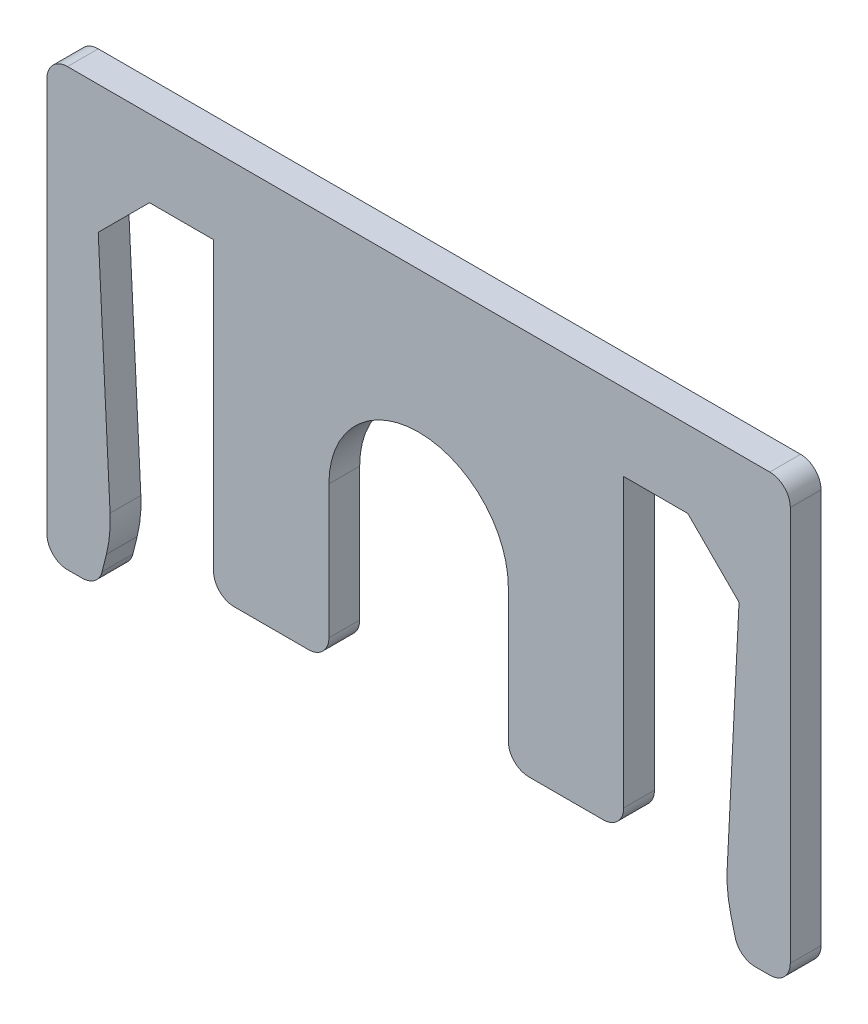
ISO-10303-21;
HEADER;
FILE_DESCRIPTION(('STEP AP214'),'2;1');
FILE_NAME('part.step','',(''),(''),'','','');
FILE_SCHEMA(('AUTOMOTIVE_DESIGN { 1 0 10303 214 1 1 1 1 }'));
ENDSEC;
DATA;
#1=APPLICATION_CONTEXT('core data for automotive mechanical design processes');
#2=APPLICATION_PROTOCOL_DEFINITION('international standard','automotive_design',2000,#1);
#3=PRODUCT_CONTEXT('',#1,'mechanical');
#4=PRODUCT('Part','Part','',(#3));
#5=PRODUCT_RELATED_PRODUCT_CATEGORY('part','',(#4));
#6=PRODUCT_DEFINITION_FORMATION('','',#4);
#7=PRODUCT_DEFINITION_CONTEXT('part definition',#1,'design');
#8=PRODUCT_DEFINITION('design','',#6,#7);
#9=PRODUCT_DEFINITION_SHAPE('','',#8);
#10=(LENGTH_UNIT() NAMED_UNIT(*) SI_UNIT(.MILLI.,.METRE.));
#11=(NAMED_UNIT(*) PLANE_ANGLE_UNIT() SI_UNIT($,.RADIAN.));
#12=(NAMED_UNIT(*) SI_UNIT($,.STERADIAN.) SOLID_ANGLE_UNIT());
#13=UNCERTAINTY_MEASURE_WITH_UNIT(LENGTH_MEASURE(1.E-05),#10,'distance_accuracy_value','');
#14=(GEOMETRIC_REPRESENTATION_CONTEXT(3) GLOBAL_UNCERTAINTY_ASSIGNED_CONTEXT((#13)) GLOBAL_UNIT_ASSIGNED_CONTEXT((#10,
#11,#12)) REPRESENTATION_CONTEXT('',''));
#15=CARTESIAN_POINT('',(0.,0.,0.));
#16=DIRECTION('',(0.,0.,1.));
#17=DIRECTION('',(1.,0.,0.));
#18=AXIS2_PLACEMENT_3D('',#15,#16,#17);
#19=CARTESIAN_POINT('',(-10.5,0.,1.2));
#20=DIRECTION('',(0.,1.,0.));
#21=DIRECTION('',(-1.,0.,0.));
#22=AXIS2_PLACEMENT_3D('',#19,#20,#21);
#23=PLANE('',#22);
#24=DIRECTION('',(1.,0.,0.));
#25=VECTOR('',#24,1.);
#26=CARTESIAN_POINT('',(-10.5,0.,0.));
#27=LINE('',#26,#25);
#28=CARTESIAN_POINT('',(-10.5,0.,0.));
#29=VERTEX_POINT('',#28);
#30=CARTESIAN_POINT('',(-8.,0.,0.));
#31=VERTEX_POINT('',#30);
#32=EDGE_CURVE('E277',#29,#31,#27,.T.);
#33=ORIENTED_EDGE('',*,*,#32,.T.);
#34=DIRECTION('',(0.,0.,-1.));
#35=VECTOR('',#34,1.);
#36=CARTESIAN_POINT('',(-8.,0.,1.2));
#37=LINE('',#36,#35);
#38=CARTESIAN_POINT('',(-8.,0.,1.2));
#39=VERTEX_POINT('',#38);
#40=EDGE_CURVE('E256',#39,#31,#37,.T.);
#41=ORIENTED_EDGE('',*,*,#40,.F.);
#42=DIRECTION('',(1.,0.,0.));
#43=VECTOR('',#42,1.);
#44=CARTESIAN_POINT('',(-10.5,0.,1.2));
#45=LINE('',#44,#43);
#46=CARTESIAN_POINT('',(-10.5,0.,1.2));
#47=VERTEX_POINT('',#46);
#48=EDGE_CURVE('E263',#47,#39,#45,.T.);
#49=ORIENTED_EDGE('',*,*,#48,.F.);
#50=DIRECTION('',(0.,0.,-1.));
#51=VECTOR('',#50,1.);
#52=CARTESIAN_POINT('',(-10.5,0.,1.2));
#53=LINE('',#52,#51);
#54=EDGE_CURVE('E518',#47,#29,#53,.T.);
#55=ORIENTED_EDGE('',*,*,#54,.T.);
#56=EDGE_LOOP('',(#33,#41,#49,#55));
#57=FACE_BOUND('',#56,.T.);
#58=ADVANCED_FACE('F39',(#57),#23,.F.);
#59=CARTESIAN_POINT('',(-8.,-12.,1.2));
#60=DIRECTION('',(1.,0.,0.));
#61=DIRECTION('',(0.,0.,-1.));
#62=AXIS2_PLACEMENT_3D('',#59,#60,#61);
#63=PLANE('',#62);
#64=DIRECTION('',(0.,-1.,0.));
#65=VECTOR('',#64,1.);
#66=CARTESIAN_POINT('',(-8.,-12.,0.));
#67=LINE('',#66,#65);
#68=CARTESIAN_POINT('',(-8.,-11.2,0.));
#69=VERTEX_POINT('',#68);
#70=EDGE_CURVE('E549',#31,#69,#67,.T.);
#71=ORIENTED_EDGE('',*,*,#70,.T.);
#72=DIRECTION('',(0.,0.,-1.));
#73=VECTOR('',#72,1.);
#74=CARTESIAN_POINT('',(-8.,-11.2,1.2));
#75=LINE('',#74,#73);
#76=CARTESIAN_POINT('',(-8.,-11.2,1.2));
#77=VERTEX_POINT('',#76);
#78=EDGE_CURVE('E259',#69,#77,#75,.F.);
#79=ORIENTED_EDGE('',*,*,#78,.T.);
#80=DIRECTION('',(0.,-1.,0.));
#81=VECTOR('',#80,1.);
#82=CARTESIAN_POINT('',(-8.,-12.,1.2));
#83=LINE('',#82,#81);
#84=EDGE_CURVE('E251',#39,#77,#83,.T.);
#85=ORIENTED_EDGE('',*,*,#84,.F.);
#86=ORIENTED_EDGE('',*,*,#40,.T.);
#87=EDGE_LOOP('',(#71,#79,#85,#86));
#88=FACE_BOUND('',#87,.T.);
#89=ADVANCED_FACE('F254',(#88),#63,.F.);
#90=CARTESIAN_POINT('',(-8.,-12.,1.2));
#91=DIRECTION('',(0.,1.,0.));
#92=DIRECTION('',(-1.,0.,0.));
#93=AXIS2_PLACEMENT_3D('',#90,#91,#92);
#94=PLANE('',#93);
#95=DIRECTION('',(1.,0.,0.));
#96=VECTOR('',#95,1.);
#97=CARTESIAN_POINT('',(-8.,-12.,1.2));
#98=LINE('',#97,#96);
#99=CARTESIAN_POINT('',(-7.2,-12.,1.2));
#100=VERTEX_POINT('',#99);
#101=CARTESIAN_POINT('',(-4.3,-12.,1.2));
#102=VERTEX_POINT('',#101);
#103=EDGE_CURVE('E262',#100,#102,#98,.T.);
#104=ORIENTED_EDGE('',*,*,#103,.F.);
#105=DIRECTION('',(0.,0.,-1.));
#106=VECTOR('',#105,1.);
#107=CARTESIAN_POINT('',(-7.2,-12.,1.2));
#108=LINE('',#107,#106);
#109=CARTESIAN_POINT('',(-7.2,-12.,0.));
#110=VERTEX_POINT('',#109);
#111=EDGE_CURVE('E418',#100,#110,#108,.T.);
#112=ORIENTED_EDGE('',*,*,#111,.T.);
#113=DIRECTION('',(1.,0.,0.));
#114=VECTOR('',#113,1.);
#115=CARTESIAN_POINT('',(-8.,-12.,0.));
#116=LINE('',#115,#114);
#117=CARTESIAN_POINT('',(-4.3,-12.,0.));
#118=VERTEX_POINT('',#117);
#119=EDGE_CURVE('E543',#110,#118,#116,.T.);
#120=ORIENTED_EDGE('',*,*,#119,.T.);
#121=DIRECTION('',(0.,0.,-1.));
#122=VECTOR('',#121,1.);
#123=CARTESIAN_POINT('',(-4.3,-12.,1.2));
#124=LINE('',#123,#122);
#125=EDGE_CURVE('E415',#118,#102,#124,.F.);
#126=ORIENTED_EDGE('',*,*,#125,.T.);
#127=EDGE_LOOP('',(#104,#112,#120,#126));
#128=FACE_BOUND('',#127,.T.);
#129=ADVANCED_FACE('F624',(#128),#94,.F.);
#130=CARTESIAN_POINT('',(-3.5,-6.,1.2));
#131=DIRECTION('',(-1.,0.,0.));
#132=DIRECTION('',(0.,-1.,0.));
#133=AXIS2_PLACEMENT_3D('',#130,#131,#132);
#134=PLANE('',#133);
#135=DIRECTION('',(0.,1.,0.));
#136=VECTOR('',#135,1.);
#137=CARTESIAN_POINT('',(-3.5,-6.,1.2));
#138=LINE('',#137,#136);
#139=CARTESIAN_POINT('',(-3.5,-11.2,1.2));
#140=VERTEX_POINT('',#139);
#141=CARTESIAN_POINT('',(-3.5,-6.,1.2));
#142=VERTEX_POINT('',#141);
#143=EDGE_CURVE('E600',#140,#142,#138,.T.);
#144=ORIENTED_EDGE('',*,*,#143,.F.);
#145=DIRECTION('',(0.,0.,-1.));
#146=VECTOR('',#145,1.);
#147=CARTESIAN_POINT('',(-3.5,-11.2,1.2));
#148=LINE('',#147,#146);
#149=CARTESIAN_POINT('',(-3.5,-11.2,0.));
#150=VERTEX_POINT('',#149);
#151=EDGE_CURVE('E11',#140,#150,#148,.T.);
#152=ORIENTED_EDGE('',*,*,#151,.T.);
#153=DIRECTION('',(0.,1.,0.));
#154=VECTOR('',#153,1.);
#155=CARTESIAN_POINT('',(-3.5,-6.,0.));
#156=LINE('',#155,#154);
#157=CARTESIAN_POINT('',(-3.5,-6.,0.));
#158=VERTEX_POINT('',#157);
#159=EDGE_CURVE('E540',#150,#158,#156,.T.);
#160=ORIENTED_EDGE('',*,*,#159,.T.);
#161=DIRECTION('',(0.,0.,-1.));
#162=VECTOR('',#161,1.);
#163=CARTESIAN_POINT('',(-3.5,-6.,1.2));
#164=LINE('',#163,#162);
#165=EDGE_CURVE('E280',#142,#158,#164,.T.);
#166=ORIENTED_EDGE('',*,*,#165,.F.);
#167=EDGE_LOOP('',(#144,#152,#160,#166));
#168=FACE_BOUND('',#167,.T.);
#169=ADVANCED_FACE('F614',(#168),#134,.F.);
#170=CARTESIAN_POINT('',(0.,-6.,1.2));
#171=DIRECTION('',(0.,0.,-1.));
#172=DIRECTION('',(-1.,0.,0.));
#173=AXIS2_PLACEMENT_3D('',#170,#171,#172);
#174=CYLINDRICAL_SURFACE('',#173,3.5);
#175=CARTESIAN_POINT('',(0.,-6.,0.));
#176=DIRECTION('',(0.,0.,-1.));
#177=DIRECTION('',(1.,0.,0.));
#178=AXIS2_PLACEMENT_3D('',#175,#176,#177);
#179=CIRCLE('',#178,3.5);
#180=CARTESIAN_POINT('',(3.5,-6.,0.));
#181=VERTEX_POINT('',#180);
#182=EDGE_CURVE('E474',#158,#181,#179,.T.);
#183=ORIENTED_EDGE('',*,*,#182,.T.);
#184=DIRECTION('',(0.,0.,-1.));
#185=VECTOR('',#184,1.);
#186=CARTESIAN_POINT('',(3.5,-6.,1.2));
#187=LINE('',#186,#185);
#188=CARTESIAN_POINT('',(3.5,-6.,1.2));
#189=VERTEX_POINT('',#188);
#190=EDGE_CURVE('E288',#189,#181,#187,.T.);
#191=ORIENTED_EDGE('',*,*,#190,.F.);
#192=CARTESIAN_POINT('',(0.,-6.,1.2));
#193=DIRECTION('',(0.,0.,-1.));
#194=DIRECTION('',(1.,0.,0.));
#195=AXIS2_PLACEMENT_3D('',#192,#193,#194);
#196=CIRCLE('',#195,3.5);
#197=EDGE_CURVE('E450',#142,#189,#196,.T.);
#198=ORIENTED_EDGE('',*,*,#197,.F.);
#199=ORIENTED_EDGE('',*,*,#165,.T.);
#200=EDGE_LOOP('',(#183,#191,#198,#199));
#201=FACE_BOUND('',#200,.T.);
#202=ADVANCED_FACE('F616',(#201),#174,.F.);
#203=CARTESIAN_POINT('',(3.5,-6.,1.2));
#204=DIRECTION('',(1.,0.,0.));
#205=DIRECTION('',(0.,1.,0.));
#206=AXIS2_PLACEMENT_3D('',#203,#204,#205);
#207=PLANE('',#206);
#208=DIRECTION('',(0.,-1.,0.));
#209=VECTOR('',#208,1.);
#210=CARTESIAN_POINT('',(3.5,-6.,0.));
#211=LINE('',#210,#209);
#212=CARTESIAN_POINT('',(3.5,-11.2,0.));
#213=VERTEX_POINT('',#212);
#214=EDGE_CURVE('E444',#181,#213,#211,.T.);
#215=ORIENTED_EDGE('',*,*,#214,.T.);
#216=DIRECTION('',(0.,0.,-1.));
#217=VECTOR('',#216,1.);
#218=CARTESIAN_POINT('',(3.5,-11.2,1.2));
#219=LINE('',#218,#217);
#220=CARTESIAN_POINT('',(3.5,-11.2,1.2));
#221=VERTEX_POINT('',#220);
#222=EDGE_CURVE('E48',#213,#221,#219,.F.);
#223=ORIENTED_EDGE('',*,*,#222,.T.);
#224=DIRECTION('',(0.,-1.,0.));
#225=VECTOR('',#224,1.);
#226=CARTESIAN_POINT('',(3.5,-6.,1.2));
#227=LINE('',#226,#225);
#228=EDGE_CURVE('E442',#189,#221,#227,.T.);
#229=ORIENTED_EDGE('',*,*,#228,.F.);
#230=ORIENTED_EDGE('',*,*,#190,.T.);
#231=EDGE_LOOP('',(#215,#223,#229,#230));
#232=FACE_BOUND('',#231,.T.);
#233=ADVANCED_FACE('F440',(#232),#207,.F.);
#234=CARTESIAN_POINT('',(3.5,-12.,1.2));
#235=DIRECTION('',(0.,1.,0.));
#236=DIRECTION('',(-1.,0.,0.));
#237=AXIS2_PLACEMENT_3D('',#234,#235,#236);
#238=PLANE('',#237);
#239=DIRECTION('',(1.,0.,0.));
#240=VECTOR('',#239,1.);
#241=CARTESIAN_POINT('',(3.5,-12.,0.));
#242=LINE('',#241,#240);
#243=CARTESIAN_POINT('',(4.3,-12.,0.));
#244=VERTEX_POINT('',#243);
#245=CARTESIAN_POINT('',(7.2,-12.,0.));
#246=VERTEX_POINT('',#245);
#247=EDGE_CURVE('E461',#244,#246,#242,.T.);
#248=ORIENTED_EDGE('',*,*,#247,.T.);
#249=DIRECTION('',(0.,0.,-1.));
#250=VECTOR('',#249,1.);
#251=CARTESIAN_POINT('',(7.2,-12.,1.2));
#252=LINE('',#251,#250);
#253=CARTESIAN_POINT('',(7.2,-12.,1.2));
#254=VERTEX_POINT('',#253);
#255=EDGE_CURVE('E432',#246,#254,#252,.F.);
#256=ORIENTED_EDGE('',*,*,#255,.T.);
#257=DIRECTION('',(1.,0.,0.));
#258=VECTOR('',#257,1.);
#259=CARTESIAN_POINT('',(3.5,-12.,1.2));
#260=LINE('',#259,#258);
#261=CARTESIAN_POINT('',(4.3,-12.,1.2));
#262=VERTEX_POINT('',#261);
#263=EDGE_CURVE('E453',#262,#254,#260,.T.);
#264=ORIENTED_EDGE('',*,*,#263,.F.);
#265=DIRECTION('',(0.,0.,-1.));
#266=VECTOR('',#265,1.);
#267=CARTESIAN_POINT('',(4.3,-12.,1.2));
#268=LINE('',#267,#266);
#269=EDGE_CURVE('E428',#262,#244,#268,.T.);
#270=ORIENTED_EDGE('',*,*,#269,.T.);
#271=EDGE_LOOP('',(#248,#256,#264,#270));
#272=FACE_BOUND('',#271,.T.);
#273=ADVANCED_FACE('F460',(#272),#238,.F.);
#274=CARTESIAN_POINT('',(8.,-12.,1.2));
#275=DIRECTION('',(-1.,0.,0.));
#276=DIRECTION('',(0.,0.,1.));
#277=AXIS2_PLACEMENT_3D('',#274,#275,#276);
#278=PLANE('',#277);
#279=DIRECTION('',(0.,1.,0.));
#280=VECTOR('',#279,1.);
#281=CARTESIAN_POINT('',(8.,-12.,1.2));
#282=LINE('',#281,#280);
#283=CARTESIAN_POINT('',(8.,-11.2,1.2));
#284=VERTEX_POINT('',#283);
#285=CARTESIAN_POINT('',(8.,0.,1.2));
#286=VERTEX_POINT('',#285);
#287=EDGE_CURVE('E593',#284,#286,#282,.T.);
#288=ORIENTED_EDGE('',*,*,#287,.F.);
#289=DIRECTION('',(0.,0.,-1.));
#290=VECTOR('',#289,1.);
#291=CARTESIAN_POINT('',(8.,-11.2,1.2));
#292=LINE('',#291,#290);
#293=CARTESIAN_POINT('',(8.,-11.2,0.));
#294=VERTEX_POINT('',#293);
#295=EDGE_CURVE('E424',#284,#294,#292,.T.);
#296=ORIENTED_EDGE('',*,*,#295,.T.);
#297=DIRECTION('',(0.,1.,0.));
#298=VECTOR('',#297,1.);
#299=CARTESIAN_POINT('',(8.,-12.,0.));
#300=LINE('',#299,#298);
#301=CARTESIAN_POINT('',(8.,0.,0.));
#302=VERTEX_POINT('',#301);
#303=EDGE_CURVE('E468',#294,#302,#300,.T.);
#304=ORIENTED_EDGE('',*,*,#303,.T.);
#305=DIRECTION('',(0.,0.,-1.));
#306=VECTOR('',#305,1.);
#307=CARTESIAN_POINT('',(8.,0.,1.2));
#308=LINE('',#307,#306);
#309=EDGE_CURVE('E533',#286,#302,#308,.T.);
#310=ORIENTED_EDGE('',*,*,#309,.F.);
#311=EDGE_LOOP('',(#288,#296,#304,#310));
#312=FACE_BOUND('',#311,.T.);
#313=ADVANCED_FACE('F834',(#312),#278,.F.);
#314=CARTESIAN_POINT('',(8.,0.,1.2));
#315=DIRECTION('',(0.,1.,0.));
#316=DIRECTION('',(-1.,0.,0.));
#317=AXIS2_PLACEMENT_3D('',#314,#315,#316);
#318=PLANE('',#317);
#319=DIRECTION('',(1.,0.,0.));
#320=VECTOR('',#319,1.);
#321=CARTESIAN_POINT('',(8.,0.,0.));
#322=LINE('',#321,#320);
#323=CARTESIAN_POINT('',(10.5,0.,0.));
#324=VERTEX_POINT('',#323);
#325=EDGE_CURVE('E472',#302,#324,#322,.T.);
#326=ORIENTED_EDGE('',*,*,#325,.T.);
#327=DIRECTION('',(0.,0.,-1.));
#328=VECTOR('',#327,1.);
#329=CARTESIAN_POINT('',(10.5,0.,1.2));
#330=LINE('',#329,#328);
#331=CARTESIAN_POINT('',(10.5,0.,1.2));
#332=VERTEX_POINT('',#331);
#333=EDGE_CURVE('E529',#332,#324,#330,.T.);
#334=ORIENTED_EDGE('',*,*,#333,.F.);
#335=DIRECTION('',(1.,0.,0.));
#336=VECTOR('',#335,1.);
#337=CARTESIAN_POINT('',(8.,0.,1.2));
#338=LINE('',#337,#336);
#339=EDGE_CURVE('E590',#286,#332,#338,.T.);
#340=ORIENTED_EDGE('',*,*,#339,.F.);
#341=ORIENTED_EDGE('',*,*,#309,.T.);
#342=EDGE_LOOP('',(#326,#334,#340,#341));
#343=FACE_BOUND('',#342,.T.);
#344=ADVANCED_FACE('F839',(#343),#318,.F.);
#345=CARTESIAN_POINT('',(12.5,-2.,1.2));
#346=DIRECTION('',(0.707106781186547,0.707106781186548,0.));
#347=DIRECTION('',(-0.707106781186548,0.707106781186547,0.));
#348=AXIS2_PLACEMENT_3D('',#345,#346,#347);
#349=PLANE('',#348);
#350=DIRECTION('',(0.707106781186548,-0.707106781186547,0.));
#351=VECTOR('',#350,1.);
#352=CARTESIAN_POINT('',(12.5,-2.,0.));
#353=LINE('',#352,#351);
#354=CARTESIAN_POINT('',(12.5,-2.,0.));
#355=VERTEX_POINT('',#354);
#356=EDGE_CURVE('E480',#324,#355,#353,.T.);
#357=ORIENTED_EDGE('',*,*,#356,.T.);
#358=DIRECTION('',(0.,0.,-1.));
#359=VECTOR('',#358,1.);
#360=CARTESIAN_POINT('',(12.5,-2.,1.2));
#361=LINE('',#360,#359);
#362=CARTESIAN_POINT('',(12.5,-2.,1.2));
#363=VERTEX_POINT('',#362);
#364=EDGE_CURVE('E525',#363,#355,#361,.T.);
#365=ORIENTED_EDGE('',*,*,#364,.F.);
#366=DIRECTION('',(0.707106781186548,-0.707106781186547,0.));
#367=VECTOR('',#366,1.);
#368=CARTESIAN_POINT('',(12.5,-2.,1.2));
#369=LINE('',#368,#367);
#370=EDGE_CURVE('E587',#332,#363,#369,.T.);
#371=ORIENTED_EDGE('',*,*,#370,.F.);
#372=ORIENTED_EDGE('',*,*,#333,.T.);
#373=EDGE_LOOP('',(#357,#365,#371,#372));
#374=FACE_BOUND('',#373,.T.);
#375=ADVANCED_FACE('F901',(#374),#349,.F.);
#376=CARTESIAN_POINT('',(12.,-12.,1.2));
#377=DIRECTION('',(0.998752338877844,-0.0499376169438947,0.));
#378=DIRECTION('',(0.0499376169438947,0.998752338877845,0.));
#379=AXIS2_PLACEMENT_3D('',#376,#377,#378);
#380=PLANE('',#379);
#381=DIRECTION('',(-0.0499376169438947,-0.998752338877845,0.));
#382=VECTOR('',#381,1.);
#383=CARTESIAN_POINT('',(12.,-12.,0.));
#384=LINE('',#383,#382);
#385=CARTESIAN_POINT('',(12.0370903931354,-11.2581921372909,0.));
#386=VERTEX_POINT('',#385);
#387=EDGE_CURVE('E483',#355,#386,#384,.T.);
#388=ORIENTED_EDGE('',*,*,#387,.T.);
#389=DIRECTION('',(0.,0.,-1.));
#390=VECTOR('',#389,1.);
#391=CARTESIAN_POINT('',(12.0370903931354,-11.2581921372909,1.2));
#392=LINE('',#391,#390);
#393=CARTESIAN_POINT('',(12.0370903931354,-11.2581921372909,1.2));
#394=VERTEX_POINT('',#393);
#395=EDGE_CURVE('E312',#386,#394,#392,.F.);
#396=ORIENTED_EDGE('',*,*,#395,.T.);
#397=DIRECTION('',(-0.0499376169438947,-0.998752338877845,0.));
#398=VECTOR('',#397,1.);
#399=CARTESIAN_POINT('',(12.,-12.,1.2));
#400=LINE('',#399,#398);
#401=EDGE_CURVE('E583',#363,#394,#400,.T.);
#402=ORIENTED_EDGE('',*,*,#401,.F.);
#403=ORIENTED_EDGE('',*,*,#364,.T.);
#404=EDGE_LOOP('',(#388,#396,#402,#403));
#405=FACE_BOUND('',#404,.T.);
#406=ADVANCED_FACE('F826',(#405),#380,.F.);
#407=CARTESIAN_POINT('',(12.5,-14.,1.2));
#408=DIRECTION('',(0.970142500145332,0.242535625036332,0.));
#409=DIRECTION('',(-0.242535625036332,0.970142500145332,0.));
#410=AXIS2_PLACEMENT_3D('',#407,#408,#409);
#411=PLANE('',#410);
#412=DIRECTION('',(0.242535625036332,-0.970142500145332,0.));
#413=VECTOR('',#412,1.);
#414=CARTESIAN_POINT('',(12.5,-14.,0.));
#415=LINE('',#414,#413);
#416=CARTESIAN_POINT('',(12.180139586798,-12.7205583471921,0.));
#417=VERTEX_POINT('',#416);
#418=CARTESIAN_POINT('',(12.3485071250072,-13.3940285000291,0.));
#419=VERTEX_POINT('',#418);
#420=EDGE_CURVE('E487',#417,#419,#415,.T.);
#421=ORIENTED_EDGE('',*,*,#420,.T.);
#422=DIRECTION('',(0.,0.,-1.));
#423=VECTOR('',#422,1.);
#424=CARTESIAN_POINT('',(12.3485071250072,-13.3940285000291,1.2));
#425=LINE('',#424,#423);
#426=CARTESIAN_POINT('',(12.3485071250072,-13.3940285000291,1.2));
#427=VERTEX_POINT('',#426);
#428=EDGE_CURVE('E408',#419,#427,#425,.F.);
#429=ORIENTED_EDGE('',*,*,#428,.T.);
#430=DIRECTION('',(0.242535625036332,-0.970142500145332,0.));
#431=VECTOR('',#430,1.);
#432=CARTESIAN_POINT('',(12.5,-14.,1.2));
#433=LINE('',#432,#431);
#434=CARTESIAN_POINT('',(12.180139586798,-12.7205583471921,1.2));
#435=VERTEX_POINT('',#434);
#436=EDGE_CURVE('E579',#435,#427,#433,.T.);
#437=ORIENTED_EDGE('',*,*,#436,.F.);
#438=DIRECTION('',(0.,0.,-1.));
#439=VECTOR('',#438,1.);
#440=CARTESIAN_POINT('',(12.180139586798,-12.7205583471921,1.2));
#441=LINE('',#440,#439);
#442=EDGE_CURVE('E308',#435,#417,#441,.T.);
#443=ORIENTED_EDGE('',*,*,#442,.T.);
#444=EDGE_LOOP('',(#421,#429,#437,#443));
#445=FACE_BOUND('',#444,.T.);
#446=ADVANCED_FACE('F816',(#445),#411,.F.);
#447=CARTESIAN_POINT('',(12.5,-14.,1.2));
#448=DIRECTION('',(0.,1.,0.));
#449=DIRECTION('',(0.,0.,1.));
#450=AXIS2_PLACEMENT_3D('',#447,#448,#449);
#451=PLANE('',#450);
#452=DIRECTION('',(1.,0.,0.));
#453=VECTOR('',#452,1.);
#454=CARTESIAN_POINT('',(12.5,-14.,0.));
#455=LINE('',#454,#453);
#456=CARTESIAN_POINT('',(13.1246211251235,-14.,0.));
#457=VERTEX_POINT('',#456);
#458=CARTESIAN_POINT('',(13.7,-14.,0.));
#459=VERTEX_POINT('',#458);
#460=EDGE_CURVE('E491',#457,#459,#455,.T.);
#461=ORIENTED_EDGE('',*,*,#460,.T.);
#462=DIRECTION('',(0.,0.,-1.));
#463=VECTOR('',#462,1.);
#464=CARTESIAN_POINT('',(13.7,-14.,1.2));
#465=LINE('',#464,#463);
#466=CARTESIAN_POINT('',(13.7,-14.,1.2));
#467=VERTEX_POINT('',#466);
#468=EDGE_CURVE('E399',#459,#467,#465,.F.);
#469=ORIENTED_EDGE('',*,*,#468,.T.);
#470=DIRECTION('',(1.,0.,0.));
#471=VECTOR('',#470,1.);
#472=CARTESIAN_POINT('',(12.5,-14.,1.2));
#473=LINE('',#472,#471);
#474=CARTESIAN_POINT('',(13.1246211251235,-14.,1.2));
#475=VERTEX_POINT('',#474);
#476=EDGE_CURVE('E575',#475,#467,#473,.T.);
#477=ORIENTED_EDGE('',*,*,#476,.F.);
#478=DIRECTION('',(0.,0.,-1.));
#479=VECTOR('',#478,1.);
#480=CARTESIAN_POINT('',(13.1246211251235,-14.,1.2));
#481=LINE('',#480,#479);
#482=EDGE_CURVE('E395',#475,#457,#481,.T.);
#483=ORIENTED_EDGE('',*,*,#482,.T.);
#484=EDGE_LOOP('',(#461,#469,#477,#483));
#485=FACE_BOUND('',#484,.T.);
#486=ADVANCED_FACE('F805',(#485),#451,.F.);
#487=CARTESIAN_POINT('',(14.5,-14.,1.2));
#488=DIRECTION('',(-1.,0.,0.));
#489=DIRECTION('',(0.,0.,1.));
#490=AXIS2_PLACEMENT_3D('',#487,#488,#489);
#491=PLANE('',#490);
#492=DIRECTION('',(0.,1.,0.));
#493=VECTOR('',#492,1.);
#494=CARTESIAN_POINT('',(14.5,-14.,0.));
#495=LINE('',#494,#493);
#496=CARTESIAN_POINT('',(14.5,-13.2,0.));
#497=VERTEX_POINT('',#496);
#498=CARTESIAN_POINT('',(14.5,2.2,0.));
#499=VERTEX_POINT('',#498);
#500=EDGE_CURVE('E495',#497,#499,#495,.T.);
#501=ORIENTED_EDGE('',*,*,#500,.T.);
#502=DIRECTION('',(0.,0.,-1.));
#503=VECTOR('',#502,1.);
#504=CARTESIAN_POINT('',(14.5,2.2,1.2));
#505=LINE('',#504,#503);
#506=CARTESIAN_POINT('',(14.5,2.2,1.2));
#507=VERTEX_POINT('',#506);
#508=EDGE_CURVE('E356',#499,#507,#505,.F.);
#509=ORIENTED_EDGE('',*,*,#508,.T.);
#510=DIRECTION('',(0.,1.,0.));
#511=VECTOR('',#510,1.);
#512=CARTESIAN_POINT('',(14.5,-14.,1.2));
#513=LINE('',#512,#511);
#514=CARTESIAN_POINT('',(14.5,-13.2,1.2));
#515=VERTEX_POINT('',#514);
#516=EDGE_CURVE('E572',#515,#507,#513,.T.);
#517=ORIENTED_EDGE('',*,*,#516,.F.);
#518=DIRECTION('',(0.,0.,-1.));
#519=VECTOR('',#518,1.);
#520=CARTESIAN_POINT('',(14.5,-13.2,1.2));
#521=LINE('',#520,#519);
#522=EDGE_CURVE('E352',#515,#497,#521,.T.);
#523=ORIENTED_EDGE('',*,*,#522,.T.);
#524=EDGE_LOOP('',(#501,#509,#517,#523));
#525=FACE_BOUND('',#524,.T.);
#526=ADVANCED_FACE('F794',(#525),#491,.F.);
#527=CARTESIAN_POINT('',(-12.5,3.,1.2));
#528=DIRECTION('',(0.,-1.,0.));
#529=DIRECTION('',(1.,0.,0.));
#530=AXIS2_PLACEMENT_3D('',#527,#528,#529);
#531=PLANE('',#530);
#532=DIRECTION('',(-1.,0.,0.));
#533=VECTOR('',#532,1.);
#534=CARTESIAN_POINT('',(12.5,3.,1.2));
#535=LINE('',#534,#533);
#536=CARTESIAN_POINT('',(13.7,3.,1.2));
#537=VERTEX_POINT('',#536);
#538=CARTESIAN_POINT('',(-13.7,3.,1.2));
#539=VERTEX_POINT('',#538);
#540=EDGE_CURVE('E568',#537,#539,#535,.T.);
#541=ORIENTED_EDGE('',*,*,#540,.F.);
#542=DIRECTION('',(0.,0.,-1.));
#543=VECTOR('',#542,1.);
#544=CARTESIAN_POINT('',(13.7,3.,1.2));
#545=LINE('',#544,#543);
#546=CARTESIAN_POINT('',(13.7,3.,0.));
#547=VERTEX_POINT('',#546);
#548=EDGE_CURVE('E318',#537,#547,#545,.T.);
#549=ORIENTED_EDGE('',*,*,#548,.T.);
#550=DIRECTION('',(-1.,0.,0.));
#551=VECTOR('',#550,1.);
#552=CARTESIAN_POINT('',(-12.5,3.,0.));
#553=LINE('',#552,#551);
#554=CARTESIAN_POINT('',(-13.7,3.,0.));
#555=VERTEX_POINT('',#554);
#556=EDGE_CURVE('E499',#547,#555,#553,.T.);
#557=ORIENTED_EDGE('',*,*,#556,.T.);
#558=DIRECTION('',(0.,0.,-1.));
#559=VECTOR('',#558,1.);
#560=CARTESIAN_POINT('',(-13.7,3.,1.2));
#561=LINE('',#560,#559);
#562=EDGE_CURVE('E315',#555,#539,#561,.F.);
#563=ORIENTED_EDGE('',*,*,#562,.T.);
#564=EDGE_LOOP('',(#541,#549,#557,#563));
#565=FACE_BOUND('',#564,.T.);
#566=ADVANCED_FACE('F784',(#565),#531,.F.);
#567=CARTESIAN_POINT('',(-14.5,-14.,1.2));
#568=DIRECTION('',(1.,0.,0.));
#569=DIRECTION('',(0.,0.,-1.));
#570=AXIS2_PLACEMENT_3D('',#567,#568,#569);
#571=PLANE('',#570);
#572=DIRECTION('',(0.,-1.,0.));
#573=VECTOR('',#572,1.);
#574=CARTESIAN_POINT('',(-14.5,-14.,1.2));
#575=LINE('',#574,#573);
#576=CARTESIAN_POINT('',(-14.5,2.2,1.2));
#577=VERTEX_POINT('',#576);
#578=CARTESIAN_POINT('',(-14.5,-13.2,1.2));
#579=VERTEX_POINT('',#578);
#580=EDGE_CURVE('E565',#577,#579,#575,.T.);
#581=ORIENTED_EDGE('',*,*,#580,.F.);
#582=DIRECTION('',(0.,0.,-1.));
#583=VECTOR('',#582,1.);
#584=CARTESIAN_POINT('',(-14.5,2.2,1.2));
#585=LINE('',#584,#583);
#586=CARTESIAN_POINT('',(-14.5,2.2,0.));
#587=VERTEX_POINT('',#586);
#588=EDGE_CURVE('E391',#577,#587,#585,.T.);
#589=ORIENTED_EDGE('',*,*,#588,.T.);
#590=DIRECTION('',(0.,-1.,0.));
#591=VECTOR('',#590,1.);
#592=CARTESIAN_POINT('',(-14.5,-14.,0.));
#593=LINE('',#592,#591);
#594=CARTESIAN_POINT('',(-14.5,-13.2,0.));
#595=VERTEX_POINT('',#594);
#596=EDGE_CURVE('E503',#587,#595,#593,.T.);
#597=ORIENTED_EDGE('',*,*,#596,.T.);
#598=DIRECTION('',(0.,0.,-1.));
#599=VECTOR('',#598,1.);
#600=CARTESIAN_POINT('',(-14.5,-13.2,1.2));
#601=LINE('',#600,#599);
#602=EDGE_CURVE('E388',#595,#579,#601,.F.);
#603=ORIENTED_EDGE('',*,*,#602,.T.);
#604=EDGE_LOOP('',(#581,#589,#597,#603));
#605=FACE_BOUND('',#604,.T.);
#606=ADVANCED_FACE('F775',(#605),#571,.F.);
#607=CARTESIAN_POINT('',(-12.5,-14.,1.2));
#608=DIRECTION('',(0.,1.,0.));
#609=DIRECTION('',(0.,0.,1.));
#610=AXIS2_PLACEMENT_3D('',#607,#608,#609);
#611=PLANE('',#610);
#612=DIRECTION('',(1.,0.,0.));
#613=VECTOR('',#612,1.);
#614=CARTESIAN_POINT('',(-12.5,-14.,1.2));
#615=LINE('',#614,#613);
#616=CARTESIAN_POINT('',(-13.7,-14.,1.2));
#617=VERTEX_POINT('',#616);
#618=CARTESIAN_POINT('',(-13.1246211251235,-14.,1.2));
#619=VERTEX_POINT('',#618);
#620=EDGE_CURVE('E562',#617,#619,#615,.T.);
#621=ORIENTED_EDGE('',*,*,#620,.F.);
#622=DIRECTION('',(0.,0.,-1.));
#623=VECTOR('',#622,1.);
#624=CARTESIAN_POINT('',(-13.7,-14.,1.2));
#625=LINE('',#624,#623);
#626=CARTESIAN_POINT('',(-13.7,-14.,0.));
#627=VERTEX_POINT('',#626);
#628=EDGE_CURVE('E404',#617,#627,#625,.T.);
#629=ORIENTED_EDGE('',*,*,#628,.T.);
#630=DIRECTION('',(1.,0.,0.));
#631=VECTOR('',#630,1.);
#632=CARTESIAN_POINT('',(-12.5,-14.,0.));
#633=LINE('',#632,#631);
#634=CARTESIAN_POINT('',(-13.1246211251235,-14.,0.));
#635=VERTEX_POINT('',#634);
#636=EDGE_CURVE('E507',#627,#635,#633,.T.);
#637=ORIENTED_EDGE('',*,*,#636,.T.);
#638=DIRECTION('',(0.,0.,-1.));
#639=VECTOR('',#638,1.);
#640=CARTESIAN_POINT('',(-13.1246211251235,-14.,1.2));
#641=LINE('',#640,#639);
#642=EDGE_CURVE('E55',#635,#619,#641,.F.);
#643=ORIENTED_EDGE('',*,*,#642,.T.);
#644=EDGE_LOOP('',(#621,#629,#637,#643));
#645=FACE_BOUND('',#644,.T.);
#646=ADVANCED_FACE('F763',(#645),#611,.F.);
#647=CARTESIAN_POINT('',(-12.,-12.,1.2));
#648=DIRECTION('',(-0.970142500145332,0.242535625036333,0.));
#649=DIRECTION('',(-0.242535625036333,-0.970142500145332,0.));
#650=AXIS2_PLACEMENT_3D('',#647,#648,#649);
#651=PLANE('',#650);
#652=DIRECTION('',(0.242535625036333,0.970142500145332,0.));
#653=VECTOR('',#652,1.);
#654=CARTESIAN_POINT('',(-12.,-12.,1.2));
#655=LINE('',#654,#653);
#656=CARTESIAN_POINT('',(-12.3485071250073,-13.3940285000291,1.2));
#657=VERTEX_POINT('',#656);
#658=CARTESIAN_POINT('',(-12.180139586798,-12.7205583471921,1.2));
#659=VERTEX_POINT('',#658);
#660=EDGE_CURVE('E559',#657,#659,#655,.T.);
#661=ORIENTED_EDGE('',*,*,#660,.F.);
#662=DIRECTION('',(0.,0.,-1.));
#663=VECTOR('',#662,1.);
#664=CARTESIAN_POINT('',(-12.3485071250073,-13.3940285000291,1.2));
#665=LINE('',#664,#663);
#666=CARTESIAN_POINT('',(-12.3485071250073,-13.3940285000291,0.));
#667=VERTEX_POINT('',#666);
#668=EDGE_CURVE('E411',#657,#667,#665,.T.);
#669=ORIENTED_EDGE('',*,*,#668,.T.);
#670=DIRECTION('',(0.242535625036333,0.970142500145332,0.));
#671=VECTOR('',#670,1.);
#672=CARTESIAN_POINT('',(-12.,-12.,0.));
#673=LINE('',#672,#671);
#674=CARTESIAN_POINT('',(-12.180139586798,-12.7205583471921,0.));
#675=VERTEX_POINT('',#674);
#676=EDGE_CURVE('E510',#667,#675,#673,.T.);
#677=ORIENTED_EDGE('',*,*,#676,.T.);
#678=DIRECTION('',(0.,0.,-1.));
#679=VECTOR('',#678,1.);
#680=CARTESIAN_POINT('',(-12.180139586798,-12.7205583471921,1.2));
#681=LINE('',#680,#679);
#682=EDGE_CURVE('E298',#675,#659,#681,.F.);
#683=ORIENTED_EDGE('',*,*,#682,.T.);
#684=EDGE_LOOP('',(#661,#669,#677,#683));
#685=FACE_BOUND('',#684,.T.);
#686=ADVANCED_FACE('F757',(#685),#651,.F.);
#687=CARTESIAN_POINT('',(-12.5,-2.,1.2));
#688=DIRECTION('',(-0.998752338877845,-0.0499376169438921,0.));
#689=DIRECTION('',(0.0499376169438921,-0.998752338877845,0.));
#690=AXIS2_PLACEMENT_3D('',#687,#688,#689);
#691=PLANE('',#690);
#692=DIRECTION('',(-0.0499376169438921,0.998752338877845,0.));
#693=VECTOR('',#692,1.);
#694=CARTESIAN_POINT('',(-12.5,-2.,1.2));
#695=LINE('',#694,#693);
#696=CARTESIAN_POINT('',(-12.0370903931355,-11.2581921372909,1.2));
#697=VERTEX_POINT('',#696);
#698=CARTESIAN_POINT('',(-12.5,-2.,1.2));
#699=VERTEX_POINT('',#698);
#700=EDGE_CURVE('E556',#697,#699,#695,.T.);
#701=ORIENTED_EDGE('',*,*,#700,.F.);
#702=DIRECTION('',(0.,0.,-1.));
#703=VECTOR('',#702,1.);
#704=CARTESIAN_POINT('',(-12.0370903931355,-11.2581921372909,1.2));
#705=LINE('',#704,#703);
#706=CARTESIAN_POINT('',(-12.0370903931355,-11.2581921372909,0.));
#707=VERTEX_POINT('',#706);
#708=EDGE_CURVE('E279',#697,#707,#705,.T.);
#709=ORIENTED_EDGE('',*,*,#708,.T.);
#710=DIRECTION('',(-0.0499376169438921,0.998752338877845,0.));
#711=VECTOR('',#710,1.);
#712=CARTESIAN_POINT('',(-12.5,-2.,0.));
#713=LINE('',#712,#711);
#714=CARTESIAN_POINT('',(-12.5,-2.,0.));
#715=VERTEX_POINT('',#714);
#716=EDGE_CURVE('E513',#707,#715,#713,.T.);
#717=ORIENTED_EDGE('',*,*,#716,.T.);
#718=DIRECTION('',(0.,0.,-1.));
#719=VECTOR('',#718,1.);
#720=CARTESIAN_POINT('',(-12.5,-2.,1.2));
#721=LINE('',#720,#719);
#722=EDGE_CURVE('E521',#699,#715,#721,.T.);
#723=ORIENTED_EDGE('',*,*,#722,.F.);
#724=EDGE_LOOP('',(#701,#709,#717,#723));
#725=FACE_BOUND('',#724,.T.);
#726=ADVANCED_FACE('F762',(#725),#691,.F.);
#727=CARTESIAN_POINT('',(-10.5,0.,1.2));
#728=DIRECTION('',(-0.707106781186547,0.707106781186548,0.));
#729=DIRECTION('',(-0.707106781186548,-0.707106781186547,0.));
#730=AXIS2_PLACEMENT_3D('',#727,#728,#729);
#731=PLANE('',#730);
#732=DIRECTION('',(0.707106781186548,0.707106781186547,0.));
#733=VECTOR('',#732,1.);
#734=CARTESIAN_POINT('',(-10.5,0.,0.));
#735=LINE('',#734,#733);
#736=EDGE_CURVE('E274',#715,#29,#735,.T.);
#737=ORIENTED_EDGE('',*,*,#736,.T.);
#738=ORIENTED_EDGE('',*,*,#54,.F.);
#739=DIRECTION('',(0.707106781186548,0.707106781186547,0.));
#740=VECTOR('',#739,1.);
#741=CARTESIAN_POINT('',(-10.5,0.,1.2));
#742=LINE('',#741,#740);
#743=EDGE_CURVE('E269',#699,#47,#742,.T.);
#744=ORIENTED_EDGE('',*,*,#743,.F.);
#745=ORIENTED_EDGE('',*,*,#722,.T.);
#746=EDGE_LOOP('',(#737,#738,#744,#745));
#747=FACE_BOUND('',#746,.T.);
#748=ADVANCED_FACE('F750',(#747),#731,.F.);
#749=CARTESIAN_POINT('',(0.,-6.,1.2));
#750=DIRECTION('',(0.,0.,1.));
#751=DIRECTION('',(1.,0.,0.));
#752=AXIS2_PLACEMENT_3D('',#749,#750,#751);
#753=PLANE('',#752);
#754=ORIENTED_EDGE('',*,*,#516,.T.);
#755=CARTESIAN_POINT('',(13.7,2.2,1.2));
#756=DIRECTION('',(0.,0.,1.));
#757=DIRECTION('',(1.,0.,0.));
#758=AXIS2_PLACEMENT_3D('',#755,#756,#757);
#759=CIRCLE('',#758,0.8);
#760=EDGE_CURVE('E385',#507,#537,#759,.T.);
#761=ORIENTED_EDGE('',*,*,#760,.T.);
#762=ORIENTED_EDGE('',*,*,#540,.T.);
#763=CARTESIAN_POINT('',(-13.7,2.2,1.2));
#764=DIRECTION('',(0.,0.,1.));
#765=DIRECTION('',(1.,0.,0.));
#766=AXIS2_PLACEMENT_3D('',#763,#764,#765);
#767=CIRCLE('',#766,0.8);
#768=EDGE_CURVE('E382',#539,#577,#767,.T.);
#769=ORIENTED_EDGE('',*,*,#768,.T.);
#770=ORIENTED_EDGE('',*,*,#580,.T.);
#771=CARTESIAN_POINT('',(-13.7,-13.2,1.2));
#772=DIRECTION('',(0.,0.,1.));
#773=DIRECTION('',(1.,0.,0.));
#774=AXIS2_PLACEMENT_3D('',#771,#772,#773);
#775=CIRCLE('',#774,0.8);
#776=EDGE_CURVE('E62',#579,#617,#775,.T.);
#777=ORIENTED_EDGE('',*,*,#776,.T.);
#778=ORIENTED_EDGE('',*,*,#620,.T.);
#779=CARTESIAN_POINT('',(-13.1246211251235,-13.2,1.2));
#780=DIRECTION('',(0.,0.,1.));
#781=DIRECTION('',(1.,0.,0.));
#782=AXIS2_PLACEMENT_3D('',#779,#780,#781);
#783=CIRCLE('',#782,0.8);
#784=EDGE_CURVE('E371',#619,#657,#783,.T.);
#785=ORIENTED_EDGE('',*,*,#784,.T.);
#786=ORIENTED_EDGE('',*,*,#660,.T.);
#787=CARTESIAN_POINT('',(-17.0308520875247,-11.5078802220104,1.2));
#788=DIRECTION('',(0.,0.,1.));
#789=DIRECTION('',(1.,0.,0.));
#790=AXIS2_PLACEMENT_3D('',#787,#788,#789);
#791=CIRCLE('',#790,5.);
#792=EDGE_CURVE('E305',#659,#697,#791,.T.);
#793=ORIENTED_EDGE('',*,*,#792,.T.);
#794=ORIENTED_EDGE('',*,*,#700,.T.);
#795=ORIENTED_EDGE('',*,*,#743,.T.);
#796=ORIENTED_EDGE('',*,*,#48,.T.);
#797=ORIENTED_EDGE('',*,*,#84,.T.);
#798=CARTESIAN_POINT('',(-7.2,-11.2,1.2));
#799=DIRECTION('',(0.,0.,1.));
#800=DIRECTION('',(1.,0.,0.));
#801=AXIS2_PLACEMENT_3D('',#798,#799,#800);
#802=CIRCLE('',#801,0.8);
#803=EDGE_CURVE('E368',#77,#100,#802,.T.);
#804=ORIENTED_EDGE('',*,*,#803,.T.);
#805=ORIENTED_EDGE('',*,*,#103,.T.);
#806=CARTESIAN_POINT('',(-4.3,-11.2,1.2));
#807=DIRECTION('',(0.,0.,1.));
#808=DIRECTION('',(1.,0.,0.));
#809=AXIS2_PLACEMENT_3D('',#806,#807,#808);
#810=CIRCLE('',#809,0.8);
#811=EDGE_CURVE('E359',#102,#140,#810,.T.);
#812=ORIENTED_EDGE('',*,*,#811,.T.);
#813=ORIENTED_EDGE('',*,*,#143,.T.);
#814=ORIENTED_EDGE('',*,*,#197,.T.);
#815=ORIENTED_EDGE('',*,*,#228,.T.);
#816=CARTESIAN_POINT('',(4.3,-11.2,1.2));
#817=DIRECTION('',(0.,0.,1.));
#818=DIRECTION('',(1.,0.,0.));
#819=AXIS2_PLACEMENT_3D('',#816,#817,#818);
#820=CIRCLE('',#819,0.8);
#821=EDGE_CURVE('E362',#221,#262,#820,.T.);
#822=ORIENTED_EDGE('',*,*,#821,.T.);
#823=ORIENTED_EDGE('',*,*,#263,.T.);
#824=CARTESIAN_POINT('',(7.2,-11.2,1.2));
#825=DIRECTION('',(0.,0.,1.));
#826=DIRECTION('',(1.,0.,0.));
#827=AXIS2_PLACEMENT_3D('',#824,#825,#826);
#828=CIRCLE('',#827,0.8);
#829=EDGE_CURVE('E365',#254,#284,#828,.T.);
#830=ORIENTED_EDGE('',*,*,#829,.T.);
#831=ORIENTED_EDGE('',*,*,#287,.T.);
#832=ORIENTED_EDGE('',*,*,#339,.T.);
#833=ORIENTED_EDGE('',*,*,#370,.T.);
#834=ORIENTED_EDGE('',*,*,#401,.T.);
#835=CARTESIAN_POINT('',(17.0308520875247,-11.5078802220104,1.2));
#836=DIRECTION('',(0.,0.,1.));
#837=DIRECTION('',(1.,0.,0.));
#838=AXIS2_PLACEMENT_3D('',#835,#836,#837);
#839=CIRCLE('',#838,5.);
#840=EDGE_CURVE('E302',#394,#435,#839,.T.);
#841=ORIENTED_EDGE('',*,*,#840,.T.);
#842=ORIENTED_EDGE('',*,*,#436,.T.);
#843=CARTESIAN_POINT('',(13.1246211251235,-13.2,1.2));
#844=DIRECTION('',(0.,0.,1.));
#845=DIRECTION('',(1.,0.,0.));
#846=AXIS2_PLACEMENT_3D('',#843,#844,#845);
#847=CIRCLE('',#846,0.8);
#848=EDGE_CURVE('E374',#427,#475,#847,.T.);
#849=ORIENTED_EDGE('',*,*,#848,.T.);
#850=ORIENTED_EDGE('',*,*,#476,.T.);
#851=CARTESIAN_POINT('',(13.7,-13.2,1.2));
#852=DIRECTION('',(0.,0.,1.));
#853=DIRECTION('',(1.,0.,0.));
#854=AXIS2_PLACEMENT_3D('',#851,#852,#853);
#855=CIRCLE('',#854,0.8);
#856=EDGE_CURVE('E379',#467,#515,#855,.T.);
#857=ORIENTED_EDGE('',*,*,#856,.T.);
#858=EDGE_LOOP('',(#754,#761,#762,#769,#770,#777,#778,#785,#786,#793,#794,#795,#796,#797,#804,
#805,#812,#813,#814,#815,#822,#823,#830,#831,#832,#833,#834,#841,#842,#849,#850,#857));
#859=FACE_BOUND('',#858,.T.);
#860=ADVANCED_FACE('F267',(#859),#753,.T.);
#861=CARTESIAN_POINT('',(0.,-6.,0.));
#862=DIRECTION('',(0.,0.,1.));
#863=DIRECTION('',(1.,0.,0.));
#864=AXIS2_PLACEMENT_3D('',#861,#862,#863);
#865=PLANE('',#864);
#866=ORIENTED_EDGE('',*,*,#556,.F.);
#867=CARTESIAN_POINT('',(13.7,2.2,0.));
#868=DIRECTION('',(0.,0.,1.));
#869=DIRECTION('',(1.,0.,0.));
#870=AXIS2_PLACEMENT_3D('',#867,#868,#869);
#871=CIRCLE('',#870,0.8);
#872=EDGE_CURVE('E349',#547,#499,#871,.F.);
#873=ORIENTED_EDGE('',*,*,#872,.T.);
#874=ORIENTED_EDGE('',*,*,#500,.F.);
#875=CARTESIAN_POINT('',(13.7,-13.2,0.));
#876=DIRECTION('',(0.,0.,1.));
#877=DIRECTION('',(1.,0.,0.));
#878=AXIS2_PLACEMENT_3D('',#875,#876,#877);
#879=CIRCLE('',#878,0.8);
#880=EDGE_CURVE('E343',#497,#459,#879,.F.);
#881=ORIENTED_EDGE('',*,*,#880,.T.);
#882=ORIENTED_EDGE('',*,*,#460,.F.);
#883=CARTESIAN_POINT('',(13.1246211251235,-13.2,0.));
#884=DIRECTION('',(0.,0.,1.));
#885=DIRECTION('',(1.,0.,0.));
#886=AXIS2_PLACEMENT_3D('',#883,#884,#885);
#887=CIRCLE('',#886,0.8);
#888=EDGE_CURVE('E337',#457,#419,#887,.F.);
#889=ORIENTED_EDGE('',*,*,#888,.T.);
#890=ORIENTED_EDGE('',*,*,#420,.F.);
#891=CARTESIAN_POINT('',(17.0308520875247,-11.5078802220104,0.));
#892=DIRECTION('',(0.,0.,1.));
#893=DIRECTION('',(1.,0.,0.));
#894=AXIS2_PLACEMENT_3D('',#891,#892,#893);
#895=CIRCLE('',#894,5.);
#896=EDGE_CURVE('E285',#417,#386,#895,.F.);
#897=ORIENTED_EDGE('',*,*,#896,.T.);
#898=ORIENTED_EDGE('',*,*,#387,.F.);
#899=ORIENTED_EDGE('',*,*,#356,.F.);
#900=ORIENTED_EDGE('',*,*,#325,.F.);
#901=ORIENTED_EDGE('',*,*,#303,.F.);
#902=CARTESIAN_POINT('',(7.2,-11.2,0.));
#903=DIRECTION('',(0.,0.,1.));
#904=DIRECTION('',(1.,0.,0.));
#905=AXIS2_PLACEMENT_3D('',#902,#903,#904);
#906=CIRCLE('',#905,0.8);
#907=EDGE_CURVE('E328',#294,#246,#906,.F.);
#908=ORIENTED_EDGE('',*,*,#907,.T.);
#909=ORIENTED_EDGE('',*,*,#247,.F.);
#910=CARTESIAN_POINT('',(4.3,-11.2,0.));
#911=DIRECTION('',(0.,0.,1.));
#912=DIRECTION('',(1.,0.,0.));
#913=AXIS2_PLACEMENT_3D('',#910,#911,#912);
#914=CIRCLE('',#913,0.8);
#915=EDGE_CURVE('E325',#244,#213,#914,.F.);
#916=ORIENTED_EDGE('',*,*,#915,.T.);
#917=ORIENTED_EDGE('',*,*,#214,.F.);
#918=ORIENTED_EDGE('',*,*,#182,.F.);
#919=ORIENTED_EDGE('',*,*,#159,.F.);
#920=CARTESIAN_POINT('',(-4.3,-11.2,0.));
#921=DIRECTION('',(0.,0.,1.));
#922=DIRECTION('',(1.,0.,0.));
#923=AXIS2_PLACEMENT_3D('',#920,#921,#922);
#924=CIRCLE('',#923,0.8);
#925=EDGE_CURVE('E322',#150,#118,#924,.F.);
#926=ORIENTED_EDGE('',*,*,#925,.T.);
#927=ORIENTED_EDGE('',*,*,#119,.F.);
#928=CARTESIAN_POINT('',(-7.2,-11.2,0.));
#929=DIRECTION('',(0.,0.,1.));
#930=DIRECTION('',(1.,0.,0.));
#931=AXIS2_PLACEMENT_3D('',#928,#929,#930);
#932=CIRCLE('',#931,0.8);
#933=EDGE_CURVE('E331',#110,#69,#932,.F.);
#934=ORIENTED_EDGE('',*,*,#933,.T.);
#935=ORIENTED_EDGE('',*,*,#70,.F.);
#936=ORIENTED_EDGE('',*,*,#32,.F.);
#937=ORIENTED_EDGE('',*,*,#736,.F.);
#938=ORIENTED_EDGE('',*,*,#716,.F.);
#939=CARTESIAN_POINT('',(-17.0308520875247,-11.5078802220104,0.));
#940=DIRECTION('',(0.,0.,1.));
#941=DIRECTION('',(1.,0.,0.));
#942=AXIS2_PLACEMENT_3D('',#939,#940,#941);
#943=CIRCLE('',#942,5.);
#944=EDGE_CURVE('E294',#707,#675,#943,.F.);
#945=ORIENTED_EDGE('',*,*,#944,.T.);
#946=ORIENTED_EDGE('',*,*,#676,.F.);
#947=CARTESIAN_POINT('',(-13.1246211251235,-13.2,0.));
#948=DIRECTION('',(0.,0.,1.));
#949=DIRECTION('',(1.,0.,0.));
#950=AXIS2_PLACEMENT_3D('',#947,#948,#949);
#951=CIRCLE('',#950,0.8);
#952=EDGE_CURVE('E334',#667,#635,#951,.F.);
#953=ORIENTED_EDGE('',*,*,#952,.T.);
#954=ORIENTED_EDGE('',*,*,#636,.F.);
#955=CARTESIAN_POINT('',(-13.7,-13.2,0.));
#956=DIRECTION('',(0.,0.,1.));
#957=DIRECTION('',(1.,0.,0.));
#958=AXIS2_PLACEMENT_3D('',#955,#956,#957);
#959=CIRCLE('',#958,0.8);
#960=EDGE_CURVE('E340',#627,#595,#959,.F.);
#961=ORIENTED_EDGE('',*,*,#960,.T.);
#962=ORIENTED_EDGE('',*,*,#596,.F.);
#963=CARTESIAN_POINT('',(-13.7,2.2,0.));
#964=DIRECTION('',(0.,0.,1.));
#965=DIRECTION('',(1.,0.,0.));
#966=AXIS2_PLACEMENT_3D('',#963,#964,#965);
#967=CIRCLE('',#966,0.8);
#968=EDGE_CURVE('E346',#587,#555,#967,.F.);
#969=ORIENTED_EDGE('',*,*,#968,.T.);
#970=EDGE_LOOP('',(#866,#873,#874,#881,#882,#889,#890,#897,#898,#899,#900,#901,#908,#909,#916,
#917,#918,#919,#926,#927,#934,#935,#936,#937,#938,#945,#946,#953,#954,#961,#962,#969));
#971=FACE_BOUND('',#970,.T.);
#972=ADVANCED_FACE('F465',(#971),#865,.F.);
#973=CARTESIAN_POINT('',(-17.0308520875247,-11.5078802220104,1.2));
#974=DIRECTION('',(0.,0.,-1.));
#975=DIRECTION('',(-1.,0.,0.));
#976=AXIS2_PLACEMENT_3D('',#973,#974,#975);
#977=CYLINDRICAL_SURFACE('',#976,5.);
#978=ORIENTED_EDGE('',*,*,#792,.F.);
#979=ORIENTED_EDGE('',*,*,#682,.F.);
#980=ORIENTED_EDGE('',*,*,#944,.F.);
#981=ORIENTED_EDGE('',*,*,#708,.F.);
#982=EDGE_LOOP('',(#978,#979,#980,#981));
#983=FACE_BOUND('',#982,.T.);
#984=ADVANCED_FACE('F634',(#983),#977,.T.);
#985=CARTESIAN_POINT('',(17.0308520875247,-11.5078802220104,1.2));
#986=DIRECTION('',(0.,0.,-1.));
#987=DIRECTION('',(-1.,0.,0.));
#988=AXIS2_PLACEMENT_3D('',#985,#986,#987);
#989=CYLINDRICAL_SURFACE('',#988,5.);
#990=ORIENTED_EDGE('',*,*,#840,.F.);
#991=ORIENTED_EDGE('',*,*,#395,.F.);
#992=ORIENTED_EDGE('',*,*,#896,.F.);
#993=ORIENTED_EDGE('',*,*,#442,.F.);
#994=EDGE_LOOP('',(#990,#991,#992,#993));
#995=FACE_BOUND('',#994,.T.);
#996=ADVANCED_FACE('F637',(#995),#989,.T.);
#997=CARTESIAN_POINT('',(13.7,2.2,1.2));
#998=DIRECTION('',(0.,0.,-1.));
#999=DIRECTION('',(-1.,0.,0.));
#1000=AXIS2_PLACEMENT_3D('',#997,#998,#999);
#1001=CYLINDRICAL_SURFACE('',#1000,0.8);
#1002=ORIENTED_EDGE('',*,*,#760,.F.);
#1003=ORIENTED_EDGE('',*,*,#508,.F.);
#1004=ORIENTED_EDGE('',*,*,#872,.F.);
#1005=ORIENTED_EDGE('',*,*,#548,.F.);
#1006=EDGE_LOOP('',(#1002,#1003,#1004,#1005));
#1007=FACE_BOUND('',#1006,.T.);
#1008=ADVANCED_FACE('F641',(#1007),#1001,.T.);
#1009=CARTESIAN_POINT('',(-13.7,2.2,1.2));
#1010=DIRECTION('',(0.,0.,-1.));
#1011=DIRECTION('',(-1.,0.,0.));
#1012=AXIS2_PLACEMENT_3D('',#1009,#1010,#1011);
#1013=CYLINDRICAL_SURFACE('',#1012,0.8);
#1014=ORIENTED_EDGE('',*,*,#768,.F.);
#1015=ORIENTED_EDGE('',*,*,#562,.F.);
#1016=ORIENTED_EDGE('',*,*,#968,.F.);
#1017=ORIENTED_EDGE('',*,*,#588,.F.);
#1018=EDGE_LOOP('',(#1014,#1015,#1016,#1017));
#1019=FACE_BOUND('',#1018,.T.);
#1020=ADVANCED_FACE('F645',(#1019),#1013,.T.);
#1021=CARTESIAN_POINT('',(13.7,-13.2,1.2));
#1022=DIRECTION('',(0.,0.,-1.));
#1023=DIRECTION('',(-1.,0.,0.));
#1024=AXIS2_PLACEMENT_3D('',#1021,#1022,#1023);
#1025=CYLINDRICAL_SURFACE('',#1024,0.8);
#1026=ORIENTED_EDGE('',*,*,#856,.F.);
#1027=ORIENTED_EDGE('',*,*,#468,.F.);
#1028=ORIENTED_EDGE('',*,*,#880,.F.);
#1029=ORIENTED_EDGE('',*,*,#522,.F.);
#1030=EDGE_LOOP('',(#1026,#1027,#1028,#1029));
#1031=FACE_BOUND('',#1030,.T.);
#1032=ADVANCED_FACE('F649',(#1031),#1025,.T.);
#1033=CARTESIAN_POINT('',(-13.7,-13.2,1.2));
#1034=DIRECTION('',(0.,0.,-1.));
#1035=DIRECTION('',(-1.,0.,0.));
#1036=AXIS2_PLACEMENT_3D('',#1033,#1034,#1035);
#1037=CYLINDRICAL_SURFACE('',#1036,0.8);
#1038=ORIENTED_EDGE('',*,*,#776,.F.);
#1039=ORIENTED_EDGE('',*,*,#602,.F.);
#1040=ORIENTED_EDGE('',*,*,#960,.F.);
#1041=ORIENTED_EDGE('',*,*,#628,.F.);
#1042=EDGE_LOOP('',(#1038,#1039,#1040,#1041));
#1043=FACE_BOUND('',#1042,.T.);
#1044=ADVANCED_FACE('F653',(#1043),#1037,.T.);
#1045=CARTESIAN_POINT('',(13.1246211251235,-13.2,1.2));
#1046=DIRECTION('',(0.,0.,-1.));
#1047=DIRECTION('',(-1.,0.,0.));
#1048=AXIS2_PLACEMENT_3D('',#1045,#1046,#1047);
#1049=CYLINDRICAL_SURFACE('',#1048,0.8);
#1050=ORIENTED_EDGE('',*,*,#848,.F.);
#1051=ORIENTED_EDGE('',*,*,#428,.F.);
#1052=ORIENTED_EDGE('',*,*,#888,.F.);
#1053=ORIENTED_EDGE('',*,*,#482,.F.);
#1054=EDGE_LOOP('',(#1050,#1051,#1052,#1053));
#1055=FACE_BOUND('',#1054,.T.);
#1056=ADVANCED_FACE('F657',(#1055),#1049,.T.);
#1057=CARTESIAN_POINT('',(-13.1246211251235,-13.2,1.2));
#1058=DIRECTION('',(0.,0.,-1.));
#1059=DIRECTION('',(-1.,0.,0.));
#1060=AXIS2_PLACEMENT_3D('',#1057,#1058,#1059);
#1061=CYLINDRICAL_SURFACE('',#1060,0.8);
#1062=ORIENTED_EDGE('',*,*,#784,.F.);
#1063=ORIENTED_EDGE('',*,*,#642,.F.);
#1064=ORIENTED_EDGE('',*,*,#952,.F.);
#1065=ORIENTED_EDGE('',*,*,#668,.F.);
#1066=EDGE_LOOP('',(#1062,#1063,#1064,#1065));
#1067=FACE_BOUND('',#1066,.T.);
#1068=ADVANCED_FACE('F661',(#1067),#1061,.T.);
#1069=CARTESIAN_POINT('',(-7.2,-11.2,1.2));
#1070=DIRECTION('',(0.,0.,-1.));
#1071=DIRECTION('',(-1.,0.,0.));
#1072=AXIS2_PLACEMENT_3D('',#1069,#1070,#1071);
#1073=CYLINDRICAL_SURFACE('',#1072,0.8);
#1074=ORIENTED_EDGE('',*,*,#803,.F.);
#1075=ORIENTED_EDGE('',*,*,#78,.F.);
#1076=ORIENTED_EDGE('',*,*,#933,.F.);
#1077=ORIENTED_EDGE('',*,*,#111,.F.);
#1078=EDGE_LOOP('',(#1074,#1075,#1076,#1077));
#1079=FACE_BOUND('',#1078,.T.);
#1080=ADVANCED_FACE('F665',(#1079),#1073,.T.);
#1081=CARTESIAN_POINT('',(7.2,-11.2,1.2));
#1082=DIRECTION('',(0.,0.,-1.));
#1083=DIRECTION('',(-1.,0.,0.));
#1084=AXIS2_PLACEMENT_3D('',#1081,#1082,#1083);
#1085=CYLINDRICAL_SURFACE('',#1084,0.8);
#1086=ORIENTED_EDGE('',*,*,#829,.F.);
#1087=ORIENTED_EDGE('',*,*,#255,.F.);
#1088=ORIENTED_EDGE('',*,*,#907,.F.);
#1089=ORIENTED_EDGE('',*,*,#295,.F.);
#1090=EDGE_LOOP('',(#1086,#1087,#1088,#1089));
#1091=FACE_BOUND('',#1090,.T.);
#1092=ADVANCED_FACE('F669',(#1091),#1085,.T.);
#1093=CARTESIAN_POINT('',(4.3,-11.2,1.2));
#1094=DIRECTION('',(0.,0.,-1.));
#1095=DIRECTION('',(-1.,0.,0.));
#1096=AXIS2_PLACEMENT_3D('',#1093,#1094,#1095);
#1097=CYLINDRICAL_SURFACE('',#1096,0.8);
#1098=ORIENTED_EDGE('',*,*,#821,.F.);
#1099=ORIENTED_EDGE('',*,*,#222,.F.);
#1100=ORIENTED_EDGE('',*,*,#915,.F.);
#1101=ORIENTED_EDGE('',*,*,#269,.F.);
#1102=EDGE_LOOP('',(#1098,#1099,#1100,#1101));
#1103=FACE_BOUND('',#1102,.T.);
#1104=ADVANCED_FACE('F456',(#1103),#1097,.T.);
#1105=CARTESIAN_POINT('',(-4.3,-11.2,1.2));
#1106=DIRECTION('',(0.,0.,-1.));
#1107=DIRECTION('',(-1.,0.,0.));
#1108=AXIS2_PLACEMENT_3D('',#1105,#1106,#1107);
#1109=CYLINDRICAL_SURFACE('',#1108,0.8);
#1110=ORIENTED_EDGE('',*,*,#811,.F.);
#1111=ORIENTED_EDGE('',*,*,#125,.F.);
#1112=ORIENTED_EDGE('',*,*,#925,.F.);
#1113=ORIENTED_EDGE('',*,*,#151,.F.);
#1114=EDGE_LOOP('',(#1110,#1111,#1112,#1113));
#1115=FACE_BOUND('',#1114,.T.);
#1116=ADVANCED_FACE('F41',(#1115),#1109,.T.);
#1117=CLOSED_SHELL('',(#58,#89,#129,#169,#202,#233,#273,#313,#344,#375,#406,#446,#486,#526,#566,
#606,#646,#686,#726,#748,#860,#972,#984,#996,#1008,#1020,#1032,#1044,#1056,#1068,#1080,#1092,
#1104,#1116));
#1118=MANIFOLD_SOLID_BREP('B2',#1117);
#1119=ADVANCED_BREP_SHAPE_REPRESENTATION('',(#18,#1118),#14);
#1120=SHAPE_DEFINITION_REPRESENTATION(#9,#1119);
ENDSEC;
END-ISO-10303-21;
